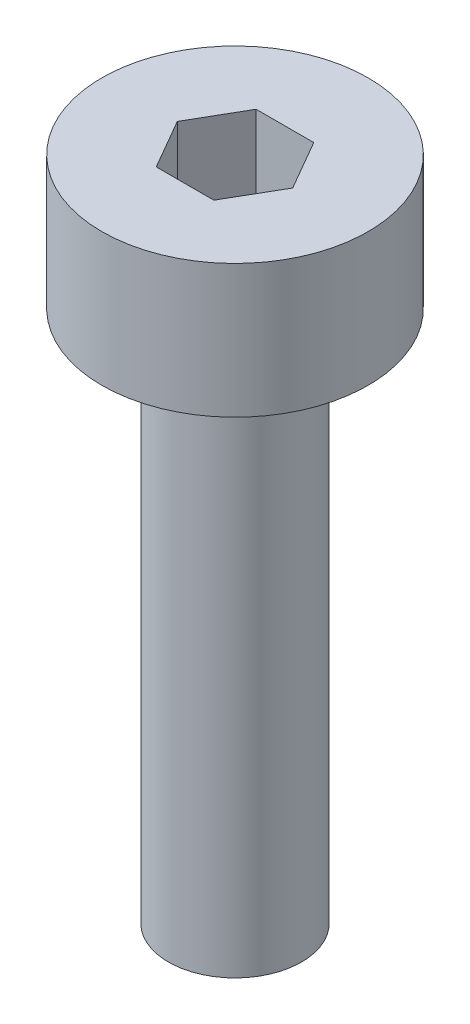
ISO-10303-21;
HEADER;
FILE_DESCRIPTION(('STEP AP214'),'2;1');
FILE_NAME('part.step','',(''),(''),'','','');
FILE_SCHEMA(('AUTOMOTIVE_DESIGN { 1 0 10303 214 1 1 1 1 }'));
ENDSEC;
DATA;
#1=APPLICATION_CONTEXT('core data for automotive mechanical design processes');
#2=APPLICATION_PROTOCOL_DEFINITION('international standard','automotive_design',2000,#1);
#3=PRODUCT_CONTEXT('',#1,'mechanical');
#4=PRODUCT('Part','Part','',(#3));
#5=PRODUCT_RELATED_PRODUCT_CATEGORY('part','',(#4));
#6=PRODUCT_DEFINITION_FORMATION('','',#4);
#7=PRODUCT_DEFINITION_CONTEXT('part definition',#1,'design');
#8=PRODUCT_DEFINITION('design','',#6,#7);
#9=PRODUCT_DEFINITION_SHAPE('','',#8);
#10=(LENGTH_UNIT() NAMED_UNIT(*) SI_UNIT(.MILLI.,.METRE.));
#11=(NAMED_UNIT(*) PLANE_ANGLE_UNIT() SI_UNIT($,.RADIAN.));
#12=(NAMED_UNIT(*) SI_UNIT($,.STERADIAN.) SOLID_ANGLE_UNIT());
#13=UNCERTAINTY_MEASURE_WITH_UNIT(LENGTH_MEASURE(1.E-05),#10,'distance_accuracy_value','');
#14=(GEOMETRIC_REPRESENTATION_CONTEXT(3) GLOBAL_UNCERTAINTY_ASSIGNED_CONTEXT((#13)) GLOBAL_UNIT_ASSIGNED_CONTEXT((#10,
#11,#12)) REPRESENTATION_CONTEXT('',''));
#15=CARTESIAN_POINT('',(0.,0.,0.));
#16=DIRECTION('',(0.,0.,1.));
#17=DIRECTION('',(1.,0.,0.));
#18=AXIS2_PLACEMENT_3D('',#15,#16,#17);
#19=CARTESIAN_POINT('',(0.,2.,0.));
#20=DIRECTION('',(0.,-1.,0.));
#21=DIRECTION('',(0.,0.,-1.));
#22=AXIS2_PLACEMENT_3D('',#19,#20,#21);
#23=CYLINDRICAL_SURFACE('',#22,2.);
#24=CARTESIAN_POINT('',(0.,2.,0.));
#25=DIRECTION('',(0.,1.,0.));
#26=DIRECTION('',(0.,0.,1.));
#27=AXIS2_PLACEMENT_3D('',#24,#25,#26);
#28=CIRCLE('',#27,2.);
#29=CARTESIAN_POINT('',(0.,2.,2.));
#30=VERTEX_POINT('',#29);
#31=EDGE_CURVE('E43',#30,#30,#28,.T.);
#32=ORIENTED_EDGE('',*,*,#31,.F.);
#33=EDGE_LOOP('',(#32));
#34=FACE_BOUND('',#33,.T.);
#35=CARTESIAN_POINT('',(0.,0.,0.));
#36=DIRECTION('',(0.,1.,0.));
#37=DIRECTION('',(0.,0.,1.));
#38=AXIS2_PLACEMENT_3D('',#35,#36,#37);
#39=CIRCLE('',#38,2.);
#40=CARTESIAN_POINT('',(0.,0.,2.));
#41=VERTEX_POINT('',#40);
#42=EDGE_CURVE('E38',#41,#41,#39,.T.);
#43=ORIENTED_EDGE('',*,*,#42,.T.);
#44=EDGE_LOOP('',(#43));
#45=FACE_BOUND('',#44,.T.);
#46=ADVANCED_FACE('F35',(#34,#45),#23,.T.);
#47=CARTESIAN_POINT('',(0.,2.,0.));
#48=DIRECTION('',(0.,1.,0.));
#49=DIRECTION('',(0.,0.,1.));
#50=AXIS2_PLACEMENT_3D('',#47,#48,#49);
#51=PLANE('',#50);
#52=DIRECTION('',(0.5,0.,-0.866025403784439));
#53=VECTOR('',#52,1.);
#54=CARTESIAN_POINT('',(0.433012701892219,2.,0.75));
#55=LINE('',#54,#53);
#56=CARTESIAN_POINT('',(0.433012701892219,2.,0.75));
#57=VERTEX_POINT('',#56);
#58=CARTESIAN_POINT('',(0.866025403784438,2.,0.));
#59=VERTEX_POINT('',#58);
#60=EDGE_CURVE('E51',#57,#59,#55,.T.);
#61=ORIENTED_EDGE('',*,*,#60,.F.);
#62=DIRECTION('',(1.,0.,0.));
#63=VECTOR('',#62,1.);
#64=CARTESIAN_POINT('',(-0.43301270189222,2.,0.75));
#65=LINE('',#64,#63);
#66=CARTESIAN_POINT('',(-0.43301270189222,2.,0.75));
#67=VERTEX_POINT('',#66);
#68=EDGE_CURVE('E135',#67,#57,#65,.T.);
#69=ORIENTED_EDGE('',*,*,#68,.F.);
#70=DIRECTION('',(0.5,0.,0.866025403784439));
#71=VECTOR('',#70,1.);
#72=CARTESIAN_POINT('',(-0.866025403784439,2.,0.));
#73=LINE('',#72,#71);
#74=CARTESIAN_POINT('',(-0.866025403784439,2.,0.));
#75=VERTEX_POINT('',#74);
#76=EDGE_CURVE('E133',#75,#67,#73,.T.);
#77=ORIENTED_EDGE('',*,*,#76,.F.);
#78=DIRECTION('',(-0.5,0.,0.866025403784439));
#79=VECTOR('',#78,1.);
#80=CARTESIAN_POINT('',(-0.43301270189222,2.,-0.750000000000001));
#81=LINE('',#80,#79);
#82=CARTESIAN_POINT('',(-0.43301270189222,2.,-0.750000000000001));
#83=VERTEX_POINT('',#82);
#84=EDGE_CURVE('E99',#83,#75,#81,.T.);
#85=ORIENTED_EDGE('',*,*,#84,.F.);
#86=DIRECTION('',(-1.,0.,0.));
#87=VECTOR('',#86,1.);
#88=CARTESIAN_POINT('',(0.433012701892219,2.,-0.75));
#89=LINE('',#88,#87);
#90=CARTESIAN_POINT('',(0.433012701892219,2.,-0.75));
#91=VERTEX_POINT('',#90);
#92=EDGE_CURVE('E129',#91,#83,#89,.T.);
#93=ORIENTED_EDGE('',*,*,#92,.F.);
#94=DIRECTION('',(-0.5,0.,-0.866025403784439));
#95=VECTOR('',#94,1.);
#96=CARTESIAN_POINT('',(0.866025403784438,2.,0.));
#97=LINE('',#96,#95);
#98=EDGE_CURVE('E125',#59,#91,#97,.T.);
#99=ORIENTED_EDGE('',*,*,#98,.F.);
#100=EDGE_LOOP('',(#61,#69,#77,#85,#93,#99));
#101=FACE_BOUND('',#100,.T.);
#102=ORIENTED_EDGE('',*,*,#31,.T.);
#103=EDGE_LOOP('',(#102));
#104=FACE_BOUND('',#103,.T.);
#105=ADVANCED_FACE('F153',(#101,#104),#51,.T.);
#106=CARTESIAN_POINT('',(0.,0.,0.));
#107=DIRECTION('',(0.,1.,0.));
#108=DIRECTION('',(0.,0.,1.));
#109=AXIS2_PLACEMENT_3D('',#106,#107,#108);
#110=PLANE('',#109);
#111=CARTESIAN_POINT('',(0.,0.,0.));
#112=DIRECTION('',(0.,-1.,0.));
#113=DIRECTION('',(0.,0.,-1.));
#114=AXIS2_PLACEMENT_3D('',#111,#112,#113);
#115=CIRCLE('',#114,1.);
#116=CARTESIAN_POINT('',(0.,0.,-1.));
#117=VERTEX_POINT('',#116);
#118=EDGE_CURVE('E11',#117,#117,#115,.T.);
#119=ORIENTED_EDGE('',*,*,#118,.F.);
#120=EDGE_LOOP('',(#119));
#121=FACE_BOUND('',#120,.T.);
#122=ORIENTED_EDGE('',*,*,#42,.F.);
#123=EDGE_LOOP('',(#122));
#124=FACE_BOUND('',#123,.T.);
#125=ADVANCED_FACE('F150',(#121,#124),#110,.F.);
#126=CARTESIAN_POINT('',(0.433012701892219,0.5,0.75));
#127=DIRECTION('',(0.866025403784439,0.,0.5));
#128=DIRECTION('',(0.5,0.,-0.866025403784439));
#129=AXIS2_PLACEMENT_3D('',#126,#127,#128);
#130=PLANE('',#129);
#131=ORIENTED_EDGE('',*,*,#60,.T.);
#132=DIRECTION('',(0.,1.,0.));
#133=VECTOR('',#132,1.);
#134=CARTESIAN_POINT('',(0.866025403784438,0.5,0.));
#135=LINE('',#134,#133);
#136=CARTESIAN_POINT('',(0.866025403784438,0.5,0.));
#137=VERTEX_POINT('',#136);
#138=EDGE_CURVE('E81',#137,#59,#135,.T.);
#139=ORIENTED_EDGE('',*,*,#138,.F.);
#140=DIRECTION('',(0.5,0.,-0.866025403784439));
#141=VECTOR('',#140,1.);
#142=CARTESIAN_POINT('',(0.433012701892219,0.5,0.75));
#143=LINE('',#142,#141);
#144=CARTESIAN_POINT('',(0.433012701892219,0.5,0.75));
#145=VERTEX_POINT('',#144);
#146=EDGE_CURVE('E137',#145,#137,#143,.T.);
#147=ORIENTED_EDGE('',*,*,#146,.F.);
#148=DIRECTION('',(0.,1.,0.));
#149=VECTOR('',#148,1.);
#150=CARTESIAN_POINT('',(0.433012701892219,0.5,0.75));
#151=LINE('',#150,#149);
#152=EDGE_CURVE('E59',#145,#57,#151,.T.);
#153=ORIENTED_EDGE('',*,*,#152,.T.);
#154=EDGE_LOOP('',(#131,#139,#147,#153));
#155=FACE_BOUND('',#154,.T.);
#156=ADVANCED_FACE('F152',(#155),#130,.F.);
#157=CARTESIAN_POINT('',(-0.43301270189222,0.5,0.75));
#158=DIRECTION('',(0.,0.,1.));
#159=DIRECTION('',(1.,0.,0.));
#160=AXIS2_PLACEMENT_3D('',#157,#158,#159);
#161=PLANE('',#160);
#162=ORIENTED_EDGE('',*,*,#68,.T.);
#163=ORIENTED_EDGE('',*,*,#152,.F.);
#164=DIRECTION('',(1.,0.,0.));
#165=VECTOR('',#164,1.);
#166=CARTESIAN_POINT('',(-0.43301270189222,0.5,0.75));
#167=LINE('',#166,#165);
#168=CARTESIAN_POINT('',(-0.43301270189222,0.5,0.75));
#169=VERTEX_POINT('',#168);
#170=EDGE_CURVE('E111',#169,#145,#167,.T.);
#171=ORIENTED_EDGE('',*,*,#170,.F.);
#172=DIRECTION('',(0.,1.,0.));
#173=VECTOR('',#172,1.);
#174=CARTESIAN_POINT('',(-0.43301270189222,0.5,0.75));
#175=LINE('',#174,#173);
#176=EDGE_CURVE('E103',#169,#67,#175,.T.);
#177=ORIENTED_EDGE('',*,*,#176,.T.);
#178=EDGE_LOOP('',(#162,#163,#171,#177));
#179=FACE_BOUND('',#178,.T.);
#180=ADVANCED_FACE('F159',(#179),#161,.F.);
#181=CARTESIAN_POINT('',(-0.866025403784439,0.5,0.));
#182=DIRECTION('',(-0.866025403784439,0.,0.5));
#183=DIRECTION('',(0.5,0.,0.866025403784439));
#184=AXIS2_PLACEMENT_3D('',#181,#182,#183);
#185=PLANE('',#184);
#186=ORIENTED_EDGE('',*,*,#76,.T.);
#187=ORIENTED_EDGE('',*,*,#176,.F.);
#188=DIRECTION('',(0.5,0.,0.866025403784439));
#189=VECTOR('',#188,1.);
#190=CARTESIAN_POINT('',(-0.866025403784439,0.5,0.));
#191=LINE('',#190,#189);
#192=CARTESIAN_POINT('',(-0.866025403784439,0.5,0.));
#193=VERTEX_POINT('',#192);
#194=EDGE_CURVE('E107',#193,#169,#191,.T.);
#195=ORIENTED_EDGE('',*,*,#194,.F.);
#196=DIRECTION('',(0.,1.,0.));
#197=VECTOR('',#196,1.);
#198=CARTESIAN_POINT('',(-0.866025403784439,0.5,0.));
#199=LINE('',#198,#197);
#200=EDGE_CURVE('E92',#193,#75,#199,.T.);
#201=ORIENTED_EDGE('',*,*,#200,.T.);
#202=EDGE_LOOP('',(#186,#187,#195,#201));
#203=FACE_BOUND('',#202,.T.);
#204=ADVANCED_FACE('F108',(#203),#185,.F.);
#205=CARTESIAN_POINT('',(-0.43301270189222,0.5,-0.750000000000001));
#206=DIRECTION('',(-0.866025403784439,0.,-0.5));
#207=DIRECTION('',(-0.5,0.,0.866025403784439));
#208=AXIS2_PLACEMENT_3D('',#205,#206,#207);
#209=PLANE('',#208);
#210=ORIENTED_EDGE('',*,*,#84,.T.);
#211=ORIENTED_EDGE('',*,*,#200,.F.);
#212=DIRECTION('',(-0.5,0.,0.866025403784439));
#213=VECTOR('',#212,1.);
#214=CARTESIAN_POINT('',(-0.43301270189222,0.5,-0.750000000000001));
#215=LINE('',#214,#213);
#216=CARTESIAN_POINT('',(-0.43301270189222,0.5,-0.750000000000001));
#217=VERTEX_POINT('',#216);
#218=EDGE_CURVE('E96',#217,#193,#215,.T.);
#219=ORIENTED_EDGE('',*,*,#218,.F.);
#220=DIRECTION('',(0.,1.,0.));
#221=VECTOR('',#220,1.);
#222=CARTESIAN_POINT('',(-0.43301270189222,0.5,-0.750000000000001));
#223=LINE('',#222,#221);
#224=EDGE_CURVE('E104',#217,#83,#223,.T.);
#225=ORIENTED_EDGE('',*,*,#224,.T.);
#226=EDGE_LOOP('',(#210,#211,#219,#225));
#227=FACE_BOUND('',#226,.T.);
#228=ADVANCED_FACE('F94',(#227),#209,.F.);
#229=CARTESIAN_POINT('',(0.433012701892219,0.5,-0.75));
#230=DIRECTION('',(0.,0.,-1.));
#231=DIRECTION('',(-1.,0.,0.));
#232=AXIS2_PLACEMENT_3D('',#229,#230,#231);
#233=PLANE('',#232);
#234=ORIENTED_EDGE('',*,*,#92,.T.);
#235=ORIENTED_EDGE('',*,*,#224,.F.);
#236=DIRECTION('',(-1.,0.,0.));
#237=VECTOR('',#236,1.);
#238=CARTESIAN_POINT('',(0.433012701892219,0.5,-0.75));
#239=LINE('',#238,#237);
#240=CARTESIAN_POINT('',(0.433012701892219,0.5,-0.75));
#241=VERTEX_POINT('',#240);
#242=EDGE_CURVE('E117',#241,#217,#239,.T.);
#243=ORIENTED_EDGE('',*,*,#242,.F.);
#244=DIRECTION('',(0.,1.,0.));
#245=VECTOR('',#244,1.);
#246=CARTESIAN_POINT('',(0.433012701892219,0.5,-0.75));
#247=LINE('',#246,#245);
#248=EDGE_CURVE('E141',#241,#91,#247,.T.);
#249=ORIENTED_EDGE('',*,*,#248,.T.);
#250=EDGE_LOOP('',(#234,#235,#243,#249));
#251=FACE_BOUND('',#250,.T.);
#252=ADVANCED_FACE('F204',(#251),#233,.F.);
#253=CARTESIAN_POINT('',(0.866025403784438,0.5,0.));
#254=DIRECTION('',(0.866025403784438,0.,-0.5));
#255=DIRECTION('',(-0.5,0.,-0.866025403784439));
#256=AXIS2_PLACEMENT_3D('',#253,#254,#255);
#257=PLANE('',#256);
#258=ORIENTED_EDGE('',*,*,#98,.T.);
#259=ORIENTED_EDGE('',*,*,#248,.F.);
#260=DIRECTION('',(-0.5,0.,-0.866025403784439));
#261=VECTOR('',#260,1.);
#262=CARTESIAN_POINT('',(0.866025403784438,0.5,0.));
#263=LINE('',#262,#261);
#264=EDGE_CURVE('E119',#137,#241,#263,.T.);
#265=ORIENTED_EDGE('',*,*,#264,.F.);
#266=ORIENTED_EDGE('',*,*,#138,.T.);
#267=EDGE_LOOP('',(#258,#259,#265,#266));
#268=FACE_BOUND('',#267,.T.);
#269=ADVANCED_FACE('F213',(#268),#257,.F.);
#270=CARTESIAN_POINT('',(0.,0.5,0.));
#271=DIRECTION('',(0.,1.,0.));
#272=DIRECTION('',(0.,0.,1.));
#273=AXIS2_PLACEMENT_3D('',#270,#271,#272);
#274=PLANE('',#273);
#275=ORIENTED_EDGE('',*,*,#146,.T.);
#276=ORIENTED_EDGE('',*,*,#264,.T.);
#277=ORIENTED_EDGE('',*,*,#242,.T.);
#278=ORIENTED_EDGE('',*,*,#218,.T.);
#279=ORIENTED_EDGE('',*,*,#194,.T.);
#280=ORIENTED_EDGE('',*,*,#170,.T.);
#281=EDGE_LOOP('',(#275,#276,#277,#278,#279,#280));
#282=FACE_BOUND('',#281,.T.);
#283=ADVANCED_FACE('F114',(#282),#274,.T.);
#284=CARTESIAN_POINT('',(0.,-8.,0.));
#285=DIRECTION('',(0.,1.,0.));
#286=DIRECTION('',(0.,0.,1.));
#287=AXIS2_PLACEMENT_3D('',#284,#285,#286);
#288=CYLINDRICAL_SURFACE('',#287,1.);
#289=CARTESIAN_POINT('',(0.,-8.,0.));
#290=DIRECTION('',(0.,-1.,0.));
#291=DIRECTION('',(0.,0.,-1.));
#292=AXIS2_PLACEMENT_3D('',#289,#290,#291);
#293=CIRCLE('',#292,1.);
#294=CARTESIAN_POINT('',(0.,-8.,-1.));
#295=VERTEX_POINT('',#294);
#296=EDGE_CURVE('E126',#295,#295,#293,.T.);
#297=ORIENTED_EDGE('',*,*,#296,.F.);
#298=EDGE_LOOP('',(#297));
#299=FACE_BOUND('',#298,.T.);
#300=ORIENTED_EDGE('',*,*,#118,.T.);
#301=EDGE_LOOP('',(#300));
#302=FACE_BOUND('',#301,.T.);
#303=ADVANCED_FACE('F231',(#299,#302),#288,.T.);
#304=CARTESIAN_POINT('',(0.,-8.,0.));
#305=DIRECTION('',(0.,-1.,0.));
#306=DIRECTION('',(0.,0.,-1.));
#307=AXIS2_PLACEMENT_3D('',#304,#305,#306);
#308=PLANE('',#307);
#309=ORIENTED_EDGE('',*,*,#296,.T.);
#310=EDGE_LOOP('',(#309));
#311=FACE_BOUND('',#310,.T.);
#312=ADVANCED_FACE('F244',(#311),#308,.T.);
#313=CLOSED_SHELL('',(#46,#105,#125,#156,#180,#204,#228,#252,#269,#283,#303,#312));
#314=MANIFOLD_SOLID_BREP('B2',#313);
#315=ADVANCED_BREP_SHAPE_REPRESENTATION('',(#18,#314),#14);
#316=SHAPE_DEFINITION_REPRESENTATION(#9,#315);
ENDSEC;
END-ISO-10303-21;
